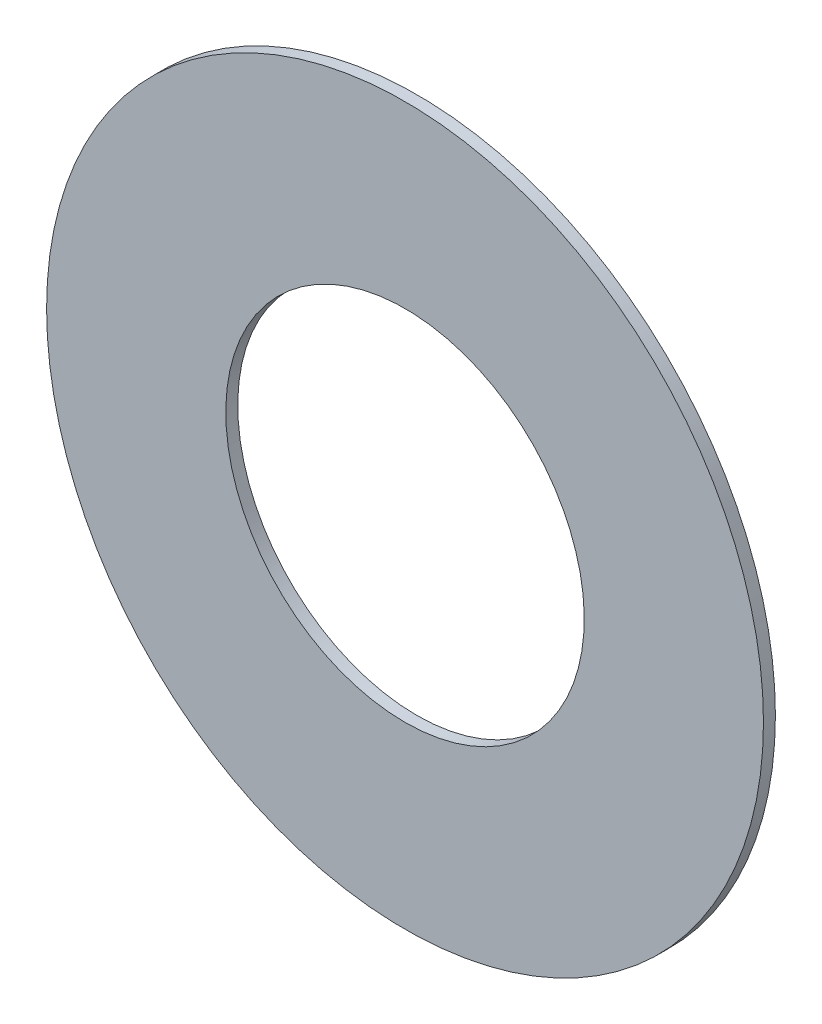
ISO-10303-21;
HEADER;
FILE_DESCRIPTION(('STEP AP214'),'2;1');
FILE_NAME('part.step','',(''),(''),'','','');
FILE_SCHEMA(('AUTOMOTIVE_DESIGN { 1 0 10303 214 1 1 1 1 }'));
ENDSEC;
DATA;
#1=APPLICATION_CONTEXT('core data for automotive mechanical design processes');
#2=APPLICATION_PROTOCOL_DEFINITION('international standard','automotive_design',2000,#1);
#3=PRODUCT_CONTEXT('',#1,'mechanical');
#4=PRODUCT('Part','Part','',(#3));
#5=PRODUCT_RELATED_PRODUCT_CATEGORY('part','',(#4));
#6=PRODUCT_DEFINITION_FORMATION('','',#4);
#7=PRODUCT_DEFINITION_CONTEXT('part definition',#1,'design');
#8=PRODUCT_DEFINITION('design','',#6,#7);
#9=PRODUCT_DEFINITION_SHAPE('','',#8);
#10=(LENGTH_UNIT() NAMED_UNIT(*) SI_UNIT(.MILLI.,.METRE.));
#11=(NAMED_UNIT(*) PLANE_ANGLE_UNIT() SI_UNIT($,.RADIAN.));
#12=(NAMED_UNIT(*) SI_UNIT($,.STERADIAN.) SOLID_ANGLE_UNIT());
#13=UNCERTAINTY_MEASURE_WITH_UNIT(LENGTH_MEASURE(1.E-05),#10,'distance_accuracy_value','');
#14=(GEOMETRIC_REPRESENTATION_CONTEXT(3) GLOBAL_UNCERTAINTY_ASSIGNED_CONTEXT((#13)) GLOBAL_UNIT_ASSIGNED_CONTEXT((#10,
#11,#12)) REPRESENTATION_CONTEXT('',''));
#15=CARTESIAN_POINT('',(0.,0.,0.));
#16=DIRECTION('',(0.,0.,1.));
#17=DIRECTION('',(1.,0.,0.));
#18=AXIS2_PLACEMENT_3D('',#15,#16,#17);
#19=CARTESIAN_POINT('',(129.352,-111.684,-0.045));
#20=DIRECTION('',(0.,0.,-1.));
#21=DIRECTION('',(0.,-1.,0.));
#22=AXIS2_PLACEMENT_3D('',#19,#20,#21);
#23=CYLINDRICAL_SURFACE('',#22,0.525);
#24=CARTESIAN_POINT('',(129.352,-111.684,-0.035));
#25=DIRECTION('',(0.,0.,-1.));
#26=DIRECTION('',(0.,-1.,0.));
#27=AXIS2_PLACEMENT_3D('',#24,#25,#26);
#28=CIRCLE('',#27,0.525);
#29=CARTESIAN_POINT('',(129.352,-112.209,-0.035));
#30=VERTEX_POINT('',#29);
#31=EDGE_CURVE('E25',#30,#30,#28,.T.);
#32=ORIENTED_EDGE('',*,*,#31,.T.);
#33=DIRECTION('',(0.,0.,1.));
#34=VECTOR('',#33,1.);
#35=CARTESIAN_POINT('',(129.352,-112.209,-0.045));
#36=LINE('',#35,#34);
#37=CARTESIAN_POINT('',(129.352,-112.209,0.));
#38=VERTEX_POINT('',#37);
#39=EDGE_CURVE('E11',#30,#38,#36,.T.);
#40=ORIENTED_EDGE('',*,*,#39,.T.);
#41=CARTESIAN_POINT('',(129.352,-111.684,0.));
#42=DIRECTION('',(0.,0.,-1.));
#43=DIRECTION('',(0.,-1.,0.));
#44=AXIS2_PLACEMENT_3D('',#41,#42,#43);
#45=CIRCLE('',#44,0.525);
#46=EDGE_CURVE('E69',#38,#38,#45,.T.);
#47=ORIENTED_EDGE('',*,*,#46,.F.);
#48=ORIENTED_EDGE('',*,*,#39,.F.);
#49=EDGE_LOOP('',(#32,#40,#47,#48));
#50=FACE_BOUND('',#49,.T.);
#51=ADVANCED_FACE('F17',(#50),#23,.F.);
#52=CARTESIAN_POINT('',(129.352,-111.684,-0.035));
#53=DIRECTION('',(0.,0.,1.));
#54=DIRECTION('',(1.,0.,0.));
#55=AXIS2_PLACEMENT_3D('',#52,#53,#54);
#56=PLANE('',#55);
#57=ORIENTED_EDGE('',*,*,#31,.F.);
#58=EDGE_LOOP('',(#57));
#59=FACE_BOUND('',#58,.T.);
#60=CARTESIAN_POINT('',(129.352,-111.684,-0.035));
#61=DIRECTION('',(0.,0.,1.));
#62=DIRECTION('',(1.,0.,0.));
#63=AXIS2_PLACEMENT_3D('',#60,#61,#62);
#64=CIRCLE('',#63,1.05);
#65=CARTESIAN_POINT('',(130.402,-111.684,-0.035));
#66=VERTEX_POINT('',#65);
#67=EDGE_CURVE('E56',#66,#66,#64,.T.);
#68=ORIENTED_EDGE('',*,*,#67,.F.);
#69=EDGE_LOOP('',(#68));
#70=FACE_BOUND('',#69,.T.);
#71=ADVANCED_FACE('F77',(#59,#70),#56,.F.);
#72=CARTESIAN_POINT('',(129.352,-111.684,0.));
#73=DIRECTION('',(0.,0.,1.));
#74=DIRECTION('',(1.,0.,0.));
#75=AXIS2_PLACEMENT_3D('',#72,#73,#74);
#76=PLANE('',#75);
#77=ORIENTED_EDGE('',*,*,#46,.T.);
#78=EDGE_LOOP('',(#77));
#79=FACE_BOUND('',#78,.T.);
#80=CARTESIAN_POINT('',(129.352,-111.684,0.));
#81=DIRECTION('',(0.,0.,1.));
#82=DIRECTION('',(1.,0.,0.));
#83=AXIS2_PLACEMENT_3D('',#80,#81,#82);
#84=CIRCLE('',#83,1.05);
#85=CARTESIAN_POINT('',(130.402,-111.684,0.));
#86=VERTEX_POINT('',#85);
#87=EDGE_CURVE('E54',#86,#86,#84,.T.);
#88=ORIENTED_EDGE('',*,*,#87,.T.);
#89=EDGE_LOOP('',(#88));
#90=FACE_BOUND('',#89,.T.);
#91=ADVANCED_FACE('F60',(#79,#90),#76,.T.);
#92=CARTESIAN_POINT('',(129.352,-111.684,-0.035));
#93=DIRECTION('',(0.,0.,1.));
#94=DIRECTION('',(1.,0.,0.));
#95=AXIS2_PLACEMENT_3D('',#92,#93,#94);
#96=CYLINDRICAL_SURFACE('',#95,1.05);
#97=ORIENTED_EDGE('',*,*,#87,.F.);
#98=DIRECTION('',(0.,0.,1.));
#99=VECTOR('',#98,1.);
#100=CARTESIAN_POINT('',(130.402,-111.684,-0.035));
#101=LINE('',#100,#99);
#102=EDGE_CURVE('E51',#66,#86,#101,.T.);
#103=ORIENTED_EDGE('',*,*,#102,.F.);
#104=ORIENTED_EDGE('',*,*,#67,.T.);
#105=ORIENTED_EDGE('',*,*,#102,.T.);
#106=EDGE_LOOP('',(#97,#103,#104,#105));
#107=FACE_BOUND('',#106,.T.);
#108=ADVANCED_FACE('F53',(#107),#96,.T.);
#109=CLOSED_SHELL('',(#51,#71,#91,#108));
#110=MANIFOLD_SOLID_BREP('B1',#109);
#111=ADVANCED_BREP_SHAPE_REPRESENTATION('',(#18,#110),#14);
#112=SHAPE_DEFINITION_REPRESENTATION(#9,#111);
ENDSEC;
END-ISO-10303-21;
